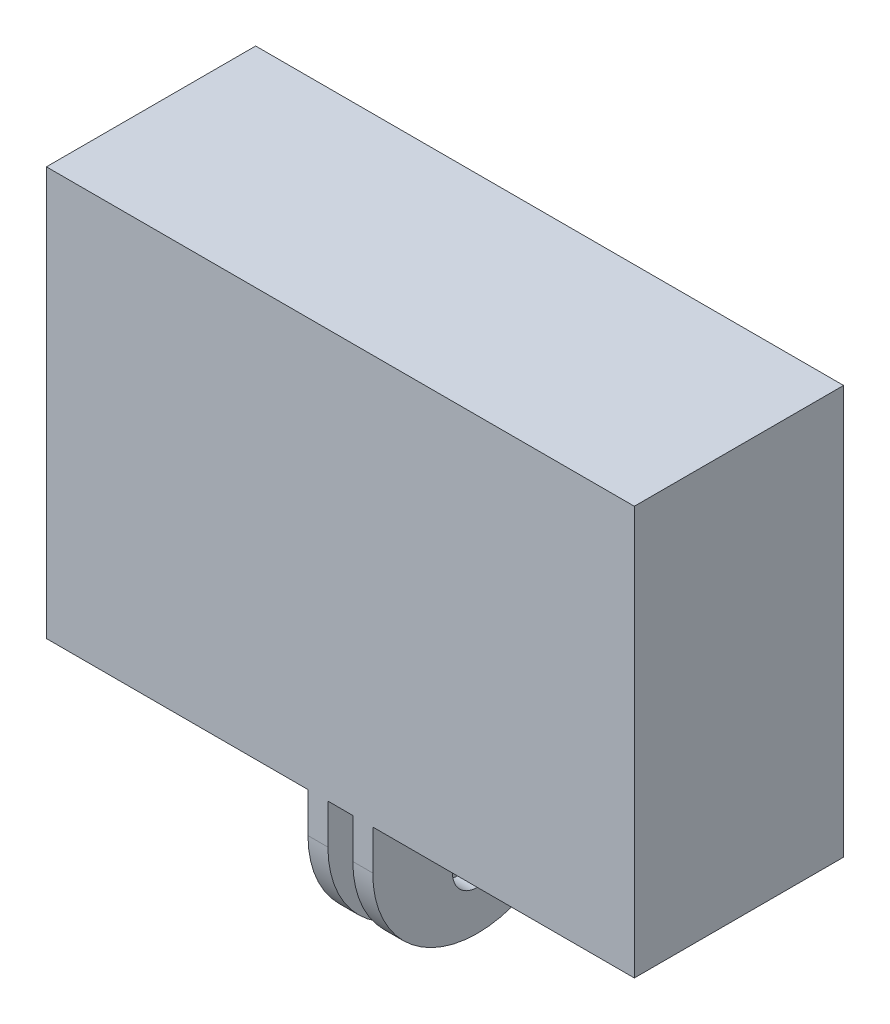
ISO-10303-21;
HEADER;
FILE_DESCRIPTION(('STEP AP214'),'2;1');
FILE_NAME('part.step','',(''),(''),'','','');
FILE_SCHEMA(('AUTOMOTIVE_DESIGN { 1 0 10303 214 1 1 1 1 }'));
ENDSEC;
DATA;
#1=APPLICATION_CONTEXT('core data for automotive mechanical design processes');
#2=APPLICATION_PROTOCOL_DEFINITION('international standard','automotive_design',2000,#1);
#3=PRODUCT_CONTEXT('',#1,'mechanical');
#4=PRODUCT('Part','Part','',(#3));
#5=PRODUCT_RELATED_PRODUCT_CATEGORY('part','',(#4));
#6=PRODUCT_DEFINITION_FORMATION('','',#4);
#7=PRODUCT_DEFINITION_CONTEXT('part definition',#1,'design');
#8=PRODUCT_DEFINITION('design','',#6,#7);
#9=PRODUCT_DEFINITION_SHAPE('','',#8);
#10=(LENGTH_UNIT() NAMED_UNIT(*) SI_UNIT(.MILLI.,.METRE.));
#11=(NAMED_UNIT(*) PLANE_ANGLE_UNIT() SI_UNIT($,.RADIAN.));
#12=(NAMED_UNIT(*) SI_UNIT($,.STERADIAN.) SOLID_ANGLE_UNIT());
#13=UNCERTAINTY_MEASURE_WITH_UNIT(LENGTH_MEASURE(1.E-05),#10,'distance_accuracy_value','');
#14=(GEOMETRIC_REPRESENTATION_CONTEXT(3) GLOBAL_UNCERTAINTY_ASSIGNED_CONTEXT((#13)) GLOBAL_UNIT_ASSIGNED_CONTEXT((#10,
#11,#12)) REPRESENTATION_CONTEXT('',''));
#15=CARTESIAN_POINT('',(0.,0.,0.));
#16=DIRECTION('',(0.,0.,1.));
#17=DIRECTION('',(1.,0.,0.));
#18=AXIS2_PLACEMENT_3D('',#15,#16,#17);
#19=CARTESIAN_POINT('',(-1.25,-8.,0.));
#20=DIRECTION('',(-1.,0.,0.));
#21=DIRECTION('',(0.,0.,1.));
#22=AXIS2_PLACEMENT_3D('',#19,#20,#21);
#23=CYLINDRICAL_SURFACE('',#22,2.5);
#24=CARTESIAN_POINT('',(-3.25,-8.,0.));
#25=DIRECTION('',(-1.,0.,0.));
#26=DIRECTION('',(0.,0.,1.));
#27=AXIS2_PLACEMENT_3D('',#24,#25,#26);
#28=CIRCLE('',#27,2.5);
#29=CARTESIAN_POINT('',(-3.25,-8.,2.5));
#30=VERTEX_POINT('',#29);
#31=EDGE_CURVE('E18',#30,#30,#28,.T.);
#32=ORIENTED_EDGE('',*,*,#31,.T.);
#33=EDGE_LOOP('',(#32));
#34=FACE_BOUND('',#33,.T.);
#35=CARTESIAN_POINT('',(-1.25,-8.,0.));
#36=DIRECTION('',(-1.,0.,0.));
#37=DIRECTION('',(0.,0.,1.));
#38=AXIS2_PLACEMENT_3D('',#35,#36,#37);
#39=CIRCLE('',#38,2.5);
#40=CARTESIAN_POINT('',(-1.25,-8.,2.5));
#41=VERTEX_POINT('',#40);
#42=EDGE_CURVE('E199',#41,#41,#39,.T.);
#43=ORIENTED_EDGE('',*,*,#42,.F.);
#44=EDGE_LOOP('',(#43));
#45=FACE_BOUND('',#44,.T.);
#46=ADVANCED_FACE('F15',(#34,#45),#23,.F.);
#47=CARTESIAN_POINT('',(1.25,-8.,0.));
#48=DIRECTION('',(-1.,0.,0.));
#49=DIRECTION('',(0.,0.,1.));
#50=AXIS2_PLACEMENT_3D('',#47,#48,#49);
#51=CYLINDRICAL_SURFACE('',#50,2.5);
#52=CARTESIAN_POINT('',(3.25,-8.,0.));
#53=DIRECTION('',(-1.,0.,0.));
#54=DIRECTION('',(0.,0.,1.));
#55=AXIS2_PLACEMENT_3D('',#52,#53,#54);
#56=CIRCLE('',#55,2.5);
#57=CARTESIAN_POINT('',(3.25,-8.,2.5));
#58=VERTEX_POINT('',#57);
#59=EDGE_CURVE('E186',#58,#58,#56,.T.);
#60=ORIENTED_EDGE('',*,*,#59,.F.);
#61=EDGE_LOOP('',(#60));
#62=FACE_BOUND('',#61,.T.);
#63=CARTESIAN_POINT('',(1.25,-8.,0.));
#64=DIRECTION('',(-1.,0.,0.));
#65=DIRECTION('',(0.,0.,1.));
#66=AXIS2_PLACEMENT_3D('',#63,#64,#65);
#67=CIRCLE('',#66,2.5);
#68=CARTESIAN_POINT('',(1.25,-8.,2.5));
#69=VERTEX_POINT('',#68);
#70=EDGE_CURVE('E195',#69,#69,#67,.T.);
#71=ORIENTED_EDGE('',*,*,#70,.T.);
#72=EDGE_LOOP('',(#71));
#73=FACE_BOUND('',#72,.T.);
#74=ADVANCED_FACE('F309',(#62,#73),#51,.F.);
#75=CARTESIAN_POINT('',(-1.25,-4.,-10.5));
#76=DIRECTION('',(0.,0.,-1.));
#77=DIRECTION('',(-1.,0.,0.));
#78=AXIS2_PLACEMENT_3D('',#75,#76,#77);
#79=PLANE('',#78);
#80=DIRECTION('',(0.,1.,0.));
#81=VECTOR('',#80,1.);
#82=CARTESIAN_POINT('',(1.25,0.,-10.5));
#83=LINE('',#82,#81);
#84=CARTESIAN_POINT('',(1.25,-4.,-10.5));
#85=VERTEX_POINT('',#84);
#86=CARTESIAN_POINT('',(1.25,0.,-10.5));
#87=VERTEX_POINT('',#86);
#88=EDGE_CURVE('E222',#85,#87,#83,.T.);
#89=ORIENTED_EDGE('',*,*,#88,.T.);
#90=DIRECTION('',(1.,0.,0.));
#91=VECTOR('',#90,1.);
#92=CARTESIAN_POINT('',(-29.5,0.,-10.5));
#93=LINE('',#92,#91);
#94=CARTESIAN_POINT('',(-1.25,0.,-10.5));
#95=VERTEX_POINT('',#94);
#96=EDGE_CURVE('E196',#95,#87,#93,.T.);
#97=ORIENTED_EDGE('',*,*,#96,.F.);
#98=DIRECTION('',(0.,1.,0.));
#99=VECTOR('',#98,1.);
#100=CARTESIAN_POINT('',(-1.25,0.,-10.5));
#101=LINE('',#100,#99);
#102=CARTESIAN_POINT('',(-1.25,-4.,-10.5));
#103=VERTEX_POINT('',#102);
#104=EDGE_CURVE('E225',#103,#95,#101,.T.);
#105=ORIENTED_EDGE('',*,*,#104,.F.);
#106=DIRECTION('',(1.,0.,0.));
#107=VECTOR('',#106,1.);
#108=CARTESIAN_POINT('',(-1.25,-4.,-10.5));
#109=LINE('',#108,#107);
#110=CARTESIAN_POINT('',(-3.25,-4.,-10.5));
#111=VERTEX_POINT('',#110);
#112=EDGE_CURVE('E114',#111,#103,#109,.T.);
#113=ORIENTED_EDGE('',*,*,#112,.F.);
#114=DIRECTION('',(0.,1.,0.));
#115=VECTOR('',#114,1.);
#116=CARTESIAN_POINT('',(-3.25,0.,-10.5));
#117=LINE('',#116,#115);
#118=CARTESIAN_POINT('',(-3.25,0.,-10.5));
#119=VERTEX_POINT('',#118);
#120=EDGE_CURVE('E111',#111,#119,#117,.T.);
#121=ORIENTED_EDGE('',*,*,#120,.T.);
#122=DIRECTION('',(1.,0.,0.));
#123=VECTOR('',#122,1.);
#124=CARTESIAN_POINT('',(-29.5,0.,-10.5));
#125=LINE('',#124,#123);
#126=CARTESIAN_POINT('',(-29.5,0.,-10.5));
#127=VERTEX_POINT('',#126);
#128=EDGE_CURVE('E142',#127,#119,#125,.T.);
#129=ORIENTED_EDGE('',*,*,#128,.F.);
#130=DIRECTION('',(0.,1.,0.));
#131=VECTOR('',#130,1.);
#132=CARTESIAN_POINT('',(-29.5,41.,-10.5));
#133=LINE('',#132,#131);
#134=CARTESIAN_POINT('',(-29.5,41.,-10.5));
#135=VERTEX_POINT('',#134);
#136=EDGE_CURVE('E150',#135,#127,#133,.F.);
#137=ORIENTED_EDGE('',*,*,#136,.F.);
#138=DIRECTION('',(1.,0.,0.));
#139=VECTOR('',#138,1.);
#140=CARTESIAN_POINT('',(29.5,41.,-10.5));
#141=LINE('',#140,#139);
#142=CARTESIAN_POINT('',(29.5,41.,-10.5));
#143=VERTEX_POINT('',#142);
#144=EDGE_CURVE('E160',#143,#135,#141,.F.);
#145=ORIENTED_EDGE('',*,*,#144,.F.);
#146=DIRECTION('',(0.,1.,0.));
#147=VECTOR('',#146,1.);
#148=CARTESIAN_POINT('',(29.5,0.,-10.5));
#149=LINE('',#148,#147);
#150=CARTESIAN_POINT('',(29.5,0.,-10.5));
#151=VERTEX_POINT('',#150);
#152=EDGE_CURVE('E171',#151,#143,#149,.T.);
#153=ORIENTED_EDGE('',*,*,#152,.F.);
#154=DIRECTION('',(1.,0.,0.));
#155=VECTOR('',#154,1.);
#156=CARTESIAN_POINT('',(-29.5,0.,-10.5));
#157=LINE('',#156,#155);
#158=CARTESIAN_POINT('',(3.25,0.,-10.5));
#159=VERTEX_POINT('',#158);
#160=EDGE_CURVE('E181',#159,#151,#157,.T.);
#161=ORIENTED_EDGE('',*,*,#160,.F.);
#162=DIRECTION('',(0.,1.,0.));
#163=VECTOR('',#162,1.);
#164=CARTESIAN_POINT('',(3.25,0.,-10.5));
#165=LINE('',#164,#163);
#166=CARTESIAN_POINT('',(3.25,-4.,-10.5));
#167=VERTEX_POINT('',#166);
#168=EDGE_CURVE('E214',#167,#159,#165,.T.);
#169=ORIENTED_EDGE('',*,*,#168,.F.);
#170=DIRECTION('',(1.,0.,0.));
#171=VECTOR('',#170,1.);
#172=CARTESIAN_POINT('',(1.25,-4.,-10.5));
#173=LINE('',#172,#171);
#174=EDGE_CURVE('E192',#85,#167,#173,.T.);
#175=ORIENTED_EDGE('',*,*,#174,.F.);
#176=EDGE_LOOP('',(#89,#97,#105,#113,#121,#129,#137,#145,#153,#161,#169,#175));
#177=FACE_BOUND('',#176,.T.);
#178=ADVANCED_FACE('F281',(#177),#79,.T.);
#179=CARTESIAN_POINT('',(29.5,0.,-10.5));
#180=DIRECTION('',(1.,0.,0.));
#181=DIRECTION('',(0.,0.,-1.));
#182=AXIS2_PLACEMENT_3D('',#179,#180,#181);
#183=PLANE('',#182);
#184=DIRECTION('',(0.,0.,-1.));
#185=VECTOR('',#184,1.);
#186=CARTESIAN_POINT('',(29.5,0.,-10.5));
#187=LINE('',#186,#185);
#188=CARTESIAN_POINT('',(29.5,0.,10.5));
#189=VERTEX_POINT('',#188);
#190=EDGE_CURVE('E178',#151,#189,#187,.F.);
#191=ORIENTED_EDGE('',*,*,#190,.F.);
#192=ORIENTED_EDGE('',*,*,#152,.T.);
#193=DIRECTION('',(0.,0.,1.));
#194=VECTOR('',#193,1.);
#195=CARTESIAN_POINT('',(29.5,41.,-10.5));
#196=LINE('',#195,#194);
#197=CARTESIAN_POINT('',(29.5,41.,10.5));
#198=VERTEX_POINT('',#197);
#199=EDGE_CURVE('E168',#198,#143,#196,.F.);
#200=ORIENTED_EDGE('',*,*,#199,.F.);
#201=DIRECTION('',(0.,1.,0.));
#202=VECTOR('',#201,1.);
#203=CARTESIAN_POINT('',(29.5,0.,10.5));
#204=LINE('',#203,#202);
#205=EDGE_CURVE('E165',#189,#198,#204,.T.);
#206=ORIENTED_EDGE('',*,*,#205,.F.);
#207=EDGE_LOOP('',(#191,#192,#200,#206));
#208=FACE_BOUND('',#207,.T.);
#209=ADVANCED_FACE('F300',(#208),#183,.T.);
#210=CARTESIAN_POINT('',(29.5,41.,-10.5));
#211=DIRECTION('',(0.,1.,0.));
#212=DIRECTION('',(0.,0.,1.));
#213=AXIS2_PLACEMENT_3D('',#210,#211,#212);
#214=PLANE('',#213);
#215=ORIENTED_EDGE('',*,*,#199,.T.);
#216=ORIENTED_EDGE('',*,*,#144,.T.);
#217=DIRECTION('',(0.,0.,1.));
#218=VECTOR('',#217,1.);
#219=CARTESIAN_POINT('',(-29.5,41.,-10.5));
#220=LINE('',#219,#218);
#221=CARTESIAN_POINT('',(-29.5,41.,10.5));
#222=VERTEX_POINT('',#221);
#223=EDGE_CURVE('E157',#222,#135,#220,.F.);
#224=ORIENTED_EDGE('',*,*,#223,.F.);
#225=DIRECTION('',(1.,0.,0.));
#226=VECTOR('',#225,1.);
#227=CARTESIAN_POINT('',(-1.25,41.,10.5));
#228=LINE('',#227,#226);
#229=EDGE_CURVE('E154',#198,#222,#228,.F.);
#230=ORIENTED_EDGE('',*,*,#229,.F.);
#231=EDGE_LOOP('',(#215,#216,#224,#230));
#232=FACE_BOUND('',#231,.T.);
#233=ADVANCED_FACE('F298',(#232),#214,.T.);
#234=CARTESIAN_POINT('',(-29.5,41.,-10.5));
#235=DIRECTION('',(-1.,0.,0.));
#236=DIRECTION('',(0.,0.,1.));
#237=AXIS2_PLACEMENT_3D('',#234,#235,#236);
#238=PLANE('',#237);
#239=ORIENTED_EDGE('',*,*,#223,.T.);
#240=ORIENTED_EDGE('',*,*,#136,.T.);
#241=DIRECTION('',(0.,0.,-1.));
#242=VECTOR('',#241,1.);
#243=CARTESIAN_POINT('',(-29.5,0.,-10.5));
#244=LINE('',#243,#242);
#245=CARTESIAN_POINT('',(-29.5,0.,10.5));
#246=VERTEX_POINT('',#245);
#247=EDGE_CURVE('E147',#246,#127,#244,.T.);
#248=ORIENTED_EDGE('',*,*,#247,.F.);
#249=DIRECTION('',(0.,1.,0.));
#250=VECTOR('',#249,1.);
#251=CARTESIAN_POINT('',(-29.5,0.,10.5));
#252=LINE('',#251,#250);
#253=EDGE_CURVE('E131',#222,#246,#252,.F.);
#254=ORIENTED_EDGE('',*,*,#253,.F.);
#255=EDGE_LOOP('',(#239,#240,#248,#254));
#256=FACE_BOUND('',#255,.T.);
#257=ADVANCED_FACE('F294',(#256),#238,.T.);
#258=CARTESIAN_POINT('',(-29.5,0.,-10.5));
#259=DIRECTION('',(0.,-1.,0.));
#260=DIRECTION('',(0.,0.,-1.));
#261=AXIS2_PLACEMENT_3D('',#258,#259,#260);
#262=PLANE('',#261);
#263=ORIENTED_EDGE('',*,*,#128,.T.);
#264=DIRECTION('',(0.,0.,-1.));
#265=VECTOR('',#264,1.);
#266=CARTESIAN_POINT('',(-3.25,0.,0.));
#267=LINE('',#266,#265);
#268=CARTESIAN_POINT('',(-3.25,0.,10.5));
#269=VERTEX_POINT('',#268);
#270=EDGE_CURVE('E138',#119,#269,#267,.F.);
#271=ORIENTED_EDGE('',*,*,#270,.T.);
#272=DIRECTION('',(1.,0.,0.));
#273=VECTOR('',#272,1.);
#274=CARTESIAN_POINT('',(-1.25,0.,10.5));
#275=LINE('',#274,#273);
#276=EDGE_CURVE('E129',#246,#269,#275,.T.);
#277=ORIENTED_EDGE('',*,*,#276,.F.);
#278=ORIENTED_EDGE('',*,*,#247,.T.);
#279=EDGE_LOOP('',(#263,#271,#277,#278));
#280=FACE_BOUND('',#279,.T.);
#281=ADVANCED_FACE('F291',(#280),#262,.T.);
#282=CARTESIAN_POINT('',(-3.25,0.,0.));
#283=DIRECTION('',(1.,0.,0.));
#284=DIRECTION('',(0.,0.,-1.));
#285=AXIS2_PLACEMENT_3D('',#282,#283,#284);
#286=PLANE('',#285);
#287=ORIENTED_EDGE('',*,*,#31,.F.);
#288=EDGE_LOOP('',(#287));
#289=FACE_BOUND('',#288,.T.);
#290=CARTESIAN_POINT('',(-3.25,-4.,0.));
#291=DIRECTION('',(1.,0.,0.));
#292=DIRECTION('',(0.,0.,-1.));
#293=AXIS2_PLACEMENT_3D('',#290,#291,#292);
#294=CIRCLE('',#293,10.5);
#295=CARTESIAN_POINT('',(-3.25,-4.,10.5));
#296=VERTEX_POINT('',#295);
#297=EDGE_CURVE('E103',#296,#111,#294,.T.);
#298=ORIENTED_EDGE('',*,*,#297,.F.);
#299=DIRECTION('',(0.,1.,0.));
#300=VECTOR('',#299,1.);
#301=CARTESIAN_POINT('',(-3.25,0.,10.5));
#302=LINE('',#301,#300);
#303=EDGE_CURVE('E108',#269,#296,#302,.F.);
#304=ORIENTED_EDGE('',*,*,#303,.F.);
#305=ORIENTED_EDGE('',*,*,#270,.F.);
#306=ORIENTED_EDGE('',*,*,#120,.F.);
#307=EDGE_LOOP('',(#298,#304,#305,#306));
#308=FACE_BOUND('',#307,.T.);
#309=ADVANCED_FACE('F105',(#289,#308),#286,.F.);
#310=CARTESIAN_POINT('',(-1.25,-4.,0.));
#311=DIRECTION('',(1.,0.,0.));
#312=DIRECTION('',(0.,0.,-1.));
#313=AXIS2_PLACEMENT_3D('',#310,#311,#312);
#314=CYLINDRICAL_SURFACE('',#313,10.5);
#315=ORIENTED_EDGE('',*,*,#112,.T.);
#316=CARTESIAN_POINT('',(-1.25,-4.,0.));
#317=DIRECTION('',(1.,0.,0.));
#318=DIRECTION('',(0.,0.,-1.));
#319=AXIS2_PLACEMENT_3D('',#316,#317,#318);
#320=CIRCLE('',#319,10.5);
#321=CARTESIAN_POINT('',(-1.25,-4.,10.5));
#322=VERTEX_POINT('',#321);
#323=EDGE_CURVE('E119',#322,#103,#320,.T.);
#324=ORIENTED_EDGE('',*,*,#323,.F.);
#325=DIRECTION('',(1.,0.,0.));
#326=VECTOR('',#325,1.);
#327=CARTESIAN_POINT('',(-1.25,-4.,10.5));
#328=LINE('',#327,#326);
#329=EDGE_CURVE('E116',#296,#322,#328,.T.);
#330=ORIENTED_EDGE('',*,*,#329,.F.);
#331=ORIENTED_EDGE('',*,*,#297,.T.);
#332=EDGE_LOOP('',(#315,#324,#330,#331));
#333=FACE_BOUND('',#332,.T.);
#334=ADVANCED_FACE('F117',(#333),#314,.T.);
#335=CARTESIAN_POINT('',(-1.25,0.,0.));
#336=DIRECTION('',(1.,0.,0.));
#337=DIRECTION('',(0.,0.,-1.));
#338=AXIS2_PLACEMENT_3D('',#335,#336,#337);
#339=PLANE('',#338);
#340=ORIENTED_EDGE('',*,*,#42,.T.);
#341=EDGE_LOOP('',(#340));
#342=FACE_BOUND('',#341,.T.);
#343=ORIENTED_EDGE('',*,*,#104,.T.);
#344=DIRECTION('',(0.,0.,-1.));
#345=VECTOR('',#344,1.);
#346=CARTESIAN_POINT('',(-1.25,0.,-10.5));
#347=LINE('',#346,#345);
#348=CARTESIAN_POINT('',(-1.25,0.,10.5));
#349=VERTEX_POINT('',#348);
#350=EDGE_CURVE('E198',#349,#95,#347,.T.);
#351=ORIENTED_EDGE('',*,*,#350,.F.);
#352=DIRECTION('',(0.,1.,0.));
#353=VECTOR('',#352,1.);
#354=CARTESIAN_POINT('',(-1.25,0.,10.5));
#355=LINE('',#354,#353);
#356=EDGE_CURVE('E123',#322,#349,#355,.T.);
#357=ORIENTED_EDGE('',*,*,#356,.F.);
#358=ORIENTED_EDGE('',*,*,#323,.T.);
#359=EDGE_LOOP('',(#343,#351,#357,#358));
#360=FACE_BOUND('',#359,.T.);
#361=ADVANCED_FACE('F328',(#342,#360),#339,.T.);
#362=CARTESIAN_POINT('',(-29.5,0.,-10.5));
#363=DIRECTION('',(0.,-1.,0.));
#364=DIRECTION('',(0.,0.,-1.));
#365=AXIS2_PLACEMENT_3D('',#362,#363,#364);
#366=PLANE('',#365);
#367=DIRECTION('',(1.,0.,0.));
#368=VECTOR('',#367,1.);
#369=CARTESIAN_POINT('',(-1.25,0.,10.5));
#370=LINE('',#369,#368);
#371=CARTESIAN_POINT('',(1.25,0.,10.5));
#372=VERTEX_POINT('',#371);
#373=EDGE_CURVE('E236',#349,#372,#370,.T.);
#374=ORIENTED_EDGE('',*,*,#373,.F.);
#375=ORIENTED_EDGE('',*,*,#350,.T.);
#376=ORIENTED_EDGE('',*,*,#96,.T.);
#377=DIRECTION('',(0.,0.,-1.));
#378=VECTOR('',#377,1.);
#379=CARTESIAN_POINT('',(1.25,0.,0.));
#380=LINE('',#379,#378);
#381=EDGE_CURVE('E240',#87,#372,#380,.F.);
#382=ORIENTED_EDGE('',*,*,#381,.T.);
#383=EDGE_LOOP('',(#374,#375,#376,#382));
#384=FACE_BOUND('',#383,.T.);
#385=ADVANCED_FACE('F287',(#384),#366,.T.);
#386=CARTESIAN_POINT('',(1.25,0.,0.));
#387=DIRECTION('',(1.,0.,0.));
#388=DIRECTION('',(0.,0.,-1.));
#389=AXIS2_PLACEMENT_3D('',#386,#387,#388);
#390=PLANE('',#389);
#391=ORIENTED_EDGE('',*,*,#70,.F.);
#392=EDGE_LOOP('',(#391));
#393=FACE_BOUND('',#392,.T.);
#394=CARTESIAN_POINT('',(1.25,-4.,0.));
#395=DIRECTION('',(1.,0.,0.));
#396=DIRECTION('',(0.,0.,-1.));
#397=AXIS2_PLACEMENT_3D('',#394,#395,#396);
#398=CIRCLE('',#397,10.5);
#399=CARTESIAN_POINT('',(1.25,-4.,10.5));
#400=VERTEX_POINT('',#399);
#401=EDGE_CURVE('E194',#400,#85,#398,.T.);
#402=ORIENTED_EDGE('',*,*,#401,.F.);
#403=DIRECTION('',(0.,1.,0.));
#404=VECTOR('',#403,1.);
#405=CARTESIAN_POINT('',(1.25,0.,10.5));
#406=LINE('',#405,#404);
#407=EDGE_CURVE('E245',#372,#400,#406,.F.);
#408=ORIENTED_EDGE('',*,*,#407,.F.);
#409=ORIENTED_EDGE('',*,*,#381,.F.);
#410=ORIENTED_EDGE('',*,*,#88,.F.);
#411=EDGE_LOOP('',(#402,#408,#409,#410));
#412=FACE_BOUND('',#411,.T.);
#413=ADVANCED_FACE('F284',(#393,#412),#390,.F.);
#414=CARTESIAN_POINT('',(1.25,-4.,0.));
#415=DIRECTION('',(1.,0.,0.));
#416=DIRECTION('',(0.,0.,-1.));
#417=AXIS2_PLACEMENT_3D('',#414,#415,#416);
#418=CYLINDRICAL_SURFACE('',#417,10.5);
#419=DIRECTION('',(1.,0.,0.));
#420=VECTOR('',#419,1.);
#421=CARTESIAN_POINT('',(-1.25,-4.,10.5));
#422=LINE('',#421,#420);
#423=CARTESIAN_POINT('',(3.25,-4.,10.5));
#424=VERTEX_POINT('',#423);
#425=EDGE_CURVE('E257',#400,#424,#422,.T.);
#426=ORIENTED_EDGE('',*,*,#425,.F.);
#427=ORIENTED_EDGE('',*,*,#401,.T.);
#428=ORIENTED_EDGE('',*,*,#174,.T.);
#429=CARTESIAN_POINT('',(3.25,-4.,0.));
#430=DIRECTION('',(1.,0.,0.));
#431=DIRECTION('',(0.,0.,-1.));
#432=AXIS2_PLACEMENT_3D('',#429,#430,#431);
#433=CIRCLE('',#432,10.5);
#434=EDGE_CURVE('E215',#424,#167,#433,.T.);
#435=ORIENTED_EDGE('',*,*,#434,.F.);
#436=EDGE_LOOP('',(#426,#427,#428,#435));
#437=FACE_BOUND('',#436,.T.);
#438=ADVANCED_FACE('F279',(#437),#418,.T.);
#439=CARTESIAN_POINT('',(3.25,0.,0.));
#440=DIRECTION('',(1.,0.,0.));
#441=DIRECTION('',(0.,0.,-1.));
#442=AXIS2_PLACEMENT_3D('',#439,#440,#441);
#443=PLANE('',#442);
#444=ORIENTED_EDGE('',*,*,#59,.T.);
#445=EDGE_LOOP('',(#444));
#446=FACE_BOUND('',#445,.T.);
#447=ORIENTED_EDGE('',*,*,#168,.T.);
#448=DIRECTION('',(0.,0.,-1.));
#449=VECTOR('',#448,1.);
#450=CARTESIAN_POINT('',(3.25,0.,-10.5));
#451=LINE('',#450,#449);
#452=CARTESIAN_POINT('',(3.25,0.,10.5));
#453=VERTEX_POINT('',#452);
#454=EDGE_CURVE('E33',#453,#159,#451,.T.);
#455=ORIENTED_EDGE('',*,*,#454,.F.);
#456=DIRECTION('',(0.,1.,0.));
#457=VECTOR('',#456,1.);
#458=CARTESIAN_POINT('',(3.25,0.,10.5));
#459=LINE('',#458,#457);
#460=EDGE_CURVE('E24',#424,#453,#459,.T.);
#461=ORIENTED_EDGE('',*,*,#460,.F.);
#462=ORIENTED_EDGE('',*,*,#434,.T.);
#463=EDGE_LOOP('',(#447,#455,#461,#462));
#464=FACE_BOUND('',#463,.T.);
#465=ADVANCED_FACE('F271',(#446,#464),#443,.T.);
#466=CARTESIAN_POINT('',(-29.5,0.,-10.5));
#467=DIRECTION('',(0.,-1.,0.));
#468=DIRECTION('',(0.,0.,-1.));
#469=AXIS2_PLACEMENT_3D('',#466,#467,#468);
#470=PLANE('',#469);
#471=DIRECTION('',(1.,0.,0.));
#472=VECTOR('',#471,1.);
#473=CARTESIAN_POINT('',(-1.25,0.,10.5));
#474=LINE('',#473,#472);
#475=EDGE_CURVE('E9',#453,#189,#474,.T.);
#476=ORIENTED_EDGE('',*,*,#475,.F.);
#477=ORIENTED_EDGE('',*,*,#454,.T.);
#478=ORIENTED_EDGE('',*,*,#160,.T.);
#479=ORIENTED_EDGE('',*,*,#190,.T.);
#480=EDGE_LOOP('',(#476,#477,#478,#479));
#481=FACE_BOUND('',#480,.T.);
#482=ADVANCED_FACE('F274',(#481),#470,.T.);
#483=CARTESIAN_POINT('',(-1.25,0.,10.5));
#484=DIRECTION('',(0.,0.,1.));
#485=DIRECTION('',(1.,0.,0.));
#486=AXIS2_PLACEMENT_3D('',#483,#484,#485);
#487=PLANE('',#486);
#488=ORIENTED_EDGE('',*,*,#460,.T.);
#489=ORIENTED_EDGE('',*,*,#475,.T.);
#490=ORIENTED_EDGE('',*,*,#205,.T.);
#491=ORIENTED_EDGE('',*,*,#229,.T.);
#492=ORIENTED_EDGE('',*,*,#253,.T.);
#493=ORIENTED_EDGE('',*,*,#276,.T.);
#494=ORIENTED_EDGE('',*,*,#303,.T.);
#495=ORIENTED_EDGE('',*,*,#329,.T.);
#496=ORIENTED_EDGE('',*,*,#356,.T.);
#497=ORIENTED_EDGE('',*,*,#373,.T.);
#498=ORIENTED_EDGE('',*,*,#407,.T.);
#499=ORIENTED_EDGE('',*,*,#425,.T.);
#500=EDGE_LOOP('',(#488,#489,#490,#491,#492,#493,#494,#495,#496,#497,#498,#499));
#501=FACE_BOUND('',#500,.T.);
#502=ADVANCED_FACE('F126',(#501),#487,.T.);
#503=CLOSED_SHELL('',(#46,#74,#178,#209,#233,#257,#281,#309,#334,#361,#385,#413,#438,#465,#482,#502));
#504=MANIFOLD_SOLID_BREP('B1',#503);
#505=ADVANCED_BREP_SHAPE_REPRESENTATION('',(#18,#504),#14);
#506=SHAPE_DEFINITION_REPRESENTATION(#9,#505);
ENDSEC;
END-ISO-10303-21;
